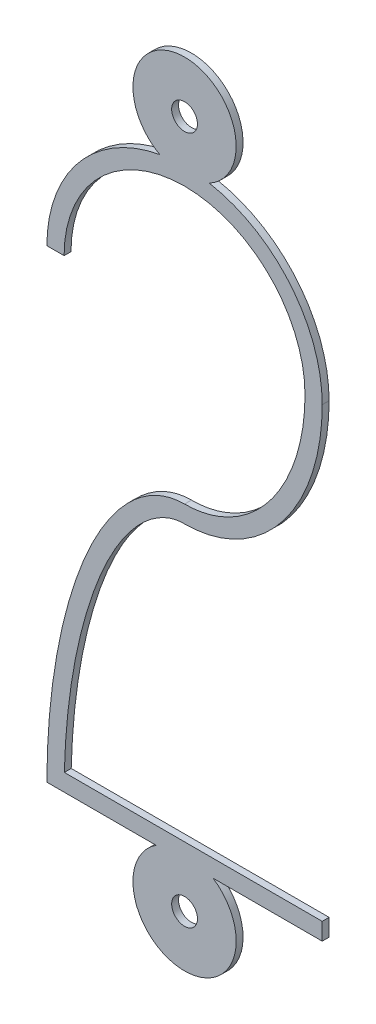
ISO-10303-21;
HEADER;
FILE_DESCRIPTION(('STEP AP214'),'2;1');
FILE_NAME('part.step','',(''),(''),'','','');
FILE_SCHEMA(('AUTOMOTIVE_DESIGN { 1 0 10303 214 1 1 1 1 }'));
ENDSEC;
DATA;
#1=APPLICATION_CONTEXT('core data for automotive mechanical design processes');
#2=APPLICATION_PROTOCOL_DEFINITION('international standard','automotive_design',2000,#1);
#3=PRODUCT_CONTEXT('',#1,'mechanical');
#4=PRODUCT('Part','Part','',(#3));
#5=PRODUCT_RELATED_PRODUCT_CATEGORY('part','',(#4));
#6=PRODUCT_DEFINITION_FORMATION('','',#4);
#7=PRODUCT_DEFINITION_CONTEXT('part definition',#1,'design');
#8=PRODUCT_DEFINITION('design','',#6,#7);
#9=PRODUCT_DEFINITION_SHAPE('','',#8);
#10=(LENGTH_UNIT() NAMED_UNIT(*) SI_UNIT(.MILLI.,.METRE.));
#11=(NAMED_UNIT(*) PLANE_ANGLE_UNIT() SI_UNIT($,.RADIAN.));
#12=(NAMED_UNIT(*) SI_UNIT($,.STERADIAN.) SOLID_ANGLE_UNIT());
#13=UNCERTAINTY_MEASURE_WITH_UNIT(LENGTH_MEASURE(1.E-05),#10,'distance_accuracy_value','');
#14=(GEOMETRIC_REPRESENTATION_CONTEXT(3) GLOBAL_UNCERTAINTY_ASSIGNED_CONTEXT((#13)) GLOBAL_UNIT_ASSIGNED_CONTEXT((#10,
#11,#12)) REPRESENTATION_CONTEXT('',''));
#15=CARTESIAN_POINT('',(0.,0.,0.));
#16=DIRECTION('',(0.,0.,1.));
#17=DIRECTION('',(1.,0.,0.));
#18=AXIS2_PLACEMENT_3D('',#15,#16,#17);
#19=CARTESIAN_POINT('',(0.,-8.75,0.1));
#20=DIRECTION('',(0.,0.,1.));
#21=DIRECTION('',(1.,0.,0.));
#22=AXIS2_PLACEMENT_3D('',#19,#20,#21);
#23=PLANE('',#22);
#24=CARTESIAN_POINT('',(0.,10.,0.1));
#25=DIRECTION('',(0.,0.,1.));
#26=DIRECTION('',(1.,0.,0.));
#27=AXIS2_PLACEMENT_3D('',#24,#25,#26);
#28=CIRCLE('',#27,0.375);
#29=CARTESIAN_POINT('',(0.375000000000002,10.,0.1));
#30=VERTEX_POINT('',#29);
#31=EDGE_CURVE('E290',#30,#30,#28,.T.);
#32=ORIENTED_EDGE('',*,*,#31,.F.);
#33=EDGE_LOOP('',(#32));
#34=FACE_BOUND('',#33,.T.);
#35=CARTESIAN_POINT('',(0.,-8.75,0.1));
#36=DIRECTION('',(0.,0.,1.));
#37=DIRECTION('',(0.,-1.,0.));
#38=AXIS2_PLACEMENT_3D('',#35,#36,#37);
#39=ELLIPSE('',#38,9.,4.);
#40=CARTESIAN_POINT('',(0.,0.25,0.1));
#41=VERTEX_POINT('',#40);
#42=CARTESIAN_POINT('',(-4.,-8.75,0.1));
#43=VERTEX_POINT('',#42);
#44=EDGE_CURVE('E286',#41,#43,#39,.T.);
#45=ORIENTED_EDGE('',*,*,#44,.T.);
#46=DIRECTION('',(1.,0.,0.));
#47=VECTOR('',#46,1.);
#48=CARTESIAN_POINT('',(-4.,-8.75,0.1));
#49=LINE('',#48,#47);
#50=CARTESIAN_POINT('',(-0.829156197588851,-8.75,0.1));
#51=VERTEX_POINT('',#50);
#52=EDGE_CURVE('E113',#43,#51,#49,.T.);
#53=ORIENTED_EDGE('',*,*,#52,.T.);
#54=CARTESIAN_POINT('',(0.,-10.,0.1));
#55=DIRECTION('',(0.,0.,1.));
#56=DIRECTION('',(1.,0.,0.));
#57=AXIS2_PLACEMENT_3D('',#54,#55,#56);
#58=CIRCLE('',#57,1.5);
#59=CARTESIAN_POINT('',(0.829156197588856,-8.75,0.1));
#60=VERTEX_POINT('',#59);
#61=EDGE_CURVE('E255',#51,#60,#58,.T.);
#62=ORIENTED_EDGE('',*,*,#61,.T.);
#63=DIRECTION('',(1.,0.,0.));
#64=VECTOR('',#63,1.);
#65=CARTESIAN_POINT('',(0.829156197588856,-8.75,0.1));
#66=LINE('',#65,#64);
#67=CARTESIAN_POINT('',(4.,-8.75,0.1));
#68=VERTEX_POINT('',#67);
#69=EDGE_CURVE('E306',#60,#68,#66,.T.);
#70=ORIENTED_EDGE('',*,*,#69,.T.);
#71=DIRECTION('',(0.,1.,0.));
#72=VECTOR('',#71,1.);
#73=CARTESIAN_POINT('',(4.,-8.75,0.1));
#74=LINE('',#73,#72);
#75=CARTESIAN_POINT('',(4.,-8.25,0.1));
#76=VERTEX_POINT('',#75);
#77=EDGE_CURVE('E308',#68,#76,#74,.T.);
#78=ORIENTED_EDGE('',*,*,#77,.T.);
#79=DIRECTION('',(-1.,0.,0.));
#80=VECTOR('',#79,1.);
#81=CARTESIAN_POINT('',(4.,-8.25,0.1));
#82=LINE('',#81,#80);
#83=CARTESIAN_POINT('',(-3.49366563897172,-8.25,0.1));
#84=VERTEX_POINT('',#83);
#85=EDGE_CURVE('E309',#76,#84,#82,.T.);
#86=ORIENTED_EDGE('',*,*,#85,.T.);
#87=CARTESIAN_POINT('',(-3.50006426004817,-8.74999971845769,0.1));
#88=CARTESIAN_POINT('',(-3.50006056152158,-8.17885806230436,0.1));
#89=CARTESIAN_POINT('',(-3.44964988153579,-7.02503319630397,0.1));
#90=CARTESIAN_POINT('',(-3.15272229711924,-4.82282843800991,0.1));
#91=CARTESIAN_POINT('',(-2.57822247255092,-2.89648588380917,0.1));
#92=CARTESIAN_POINT('',(-1.81455832713496,-1.49273960815074,0.1));
#93=CARTESIAN_POINT('',(-1.19033596288793,-0.745574392309451,0.1));
#94=CARTESIAN_POINT('',(-0.563172920007675,-0.33007672348668,0.1));
#95=CARTESIAN_POINT('',(-0.196814508086079,-0.249998725493591,0.1));
#96=CARTESIAN_POINT('',(0.,-0.249999999999989,0.1));
#97=B_SPLINE_CURVE_WITH_KNOTS('',3,(#87,#88,#89,#90,#91,#92,#93,#94,#95,#96),.UNSPECIFIED.,.F.,
.F.,(4,1,1,1,1,1,1,4),(3.14159265358979,3.33794219443916,3.53429173528852,3.92699081698724,
4.1233403578366,4.31968989868597,4.51603943953533,4.71238898038469),.UNSPECIFIED.);
#98=CARTESIAN_POINT('',(0.,-0.249999999999989,0.1));
#99=VERTEX_POINT('',#98);
#100=EDGE_CURVE('E207',#84,#99,#97,.T.);
#101=ORIENTED_EDGE('',*,*,#100,.T.);
#102=CARTESIAN_POINT('',(0.,4.75,0.1));
#103=DIRECTION('',(0.,0.,1.));
#104=DIRECTION('',(0.,1.,0.));
#105=AXIS2_PLACEMENT_3D('',#102,#103,#104);
#106=ELLIPSE('',#105,5.,4.);
#107=CARTESIAN_POINT('',(4.,4.75,0.1));
#108=VERTEX_POINT('',#107);
#109=EDGE_CURVE('E203',#99,#108,#106,.T.);
#110=ORIENTED_EDGE('',*,*,#109,.T.);
#111=CARTESIAN_POINT('',(0.,4.75,0.1));
#112=DIRECTION('',(0.,0.,1.));
#113=DIRECTION('',(-1.,0.,0.));
#114=AXIS2_PLACEMENT_3D('',#111,#112,#113);
#115=CIRCLE('',#114,4.);
#116=CARTESIAN_POINT('',(0.720779017653992,8.68452380952381,0.1));
#117=VERTEX_POINT('',#116);
#118=EDGE_CURVE('E206',#108,#117,#115,.T.);
#119=ORIENTED_EDGE('',*,*,#118,.T.);
#120=CARTESIAN_POINT('',(0.,10.,0.1));
#121=DIRECTION('',(0.,0.,1.));
#122=DIRECTION('',(1.,0.,0.));
#123=AXIS2_PLACEMENT_3D('',#120,#121,#122);
#124=CIRCLE('',#123,1.5);
#125=CARTESIAN_POINT('',(-0.720779017653989,8.68452380952381,0.1));
#126=VERTEX_POINT('',#125);
#127=EDGE_CURVE('E213',#117,#126,#124,.T.);
#128=ORIENTED_EDGE('',*,*,#127,.T.);
#129=CARTESIAN_POINT('',(0.,4.75,0.1));
#130=DIRECTION('',(0.,0.,1.));
#131=DIRECTION('',(-1.,0.,0.));
#132=AXIS2_PLACEMENT_3D('',#129,#130,#131);
#133=CIRCLE('',#132,4.);
#134=CARTESIAN_POINT('',(-4.,4.75,0.1));
#135=VERTEX_POINT('',#134);
#136=EDGE_CURVE('E150',#126,#135,#133,.T.);
#137=ORIENTED_EDGE('',*,*,#136,.T.);
#138=DIRECTION('',(1.,0.,0.));
#139=VECTOR('',#138,1.);
#140=CARTESIAN_POINT('',(-4.,4.75,0.1));
#141=LINE('',#140,#139);
#142=CARTESIAN_POINT('',(-3.5,4.75,0.1));
#143=VERTEX_POINT('',#142);
#144=EDGE_CURVE('E144',#135,#143,#141,.T.);
#145=ORIENTED_EDGE('',*,*,#144,.T.);
#146=CARTESIAN_POINT('',(0.,4.75,0.1));
#147=DIRECTION('',(0.,0.,-1.));
#148=DIRECTION('',(-1.,0.,0.));
#149=AXIS2_PLACEMENT_3D('',#146,#147,#148);
#150=CIRCLE('',#149,3.5);
#151=CARTESIAN_POINT('',(3.5,4.75,0.1));
#152=VERTEX_POINT('',#151);
#153=EDGE_CURVE('E148',#143,#152,#150,.T.);
#154=ORIENTED_EDGE('',*,*,#153,.T.);
#155=CARTESIAN_POINT('',(0.,4.75,0.1));
#156=DIRECTION('',(0.,0.,-1.));
#157=DIRECTION('',(0.,1.,0.));
#158=AXIS2_PLACEMENT_3D('',#155,#156,#157);
#159=ELLIPSE('',#158,4.5,3.5);
#160=EDGE_CURVE('E52',#152,#41,#159,.T.);
#161=ORIENTED_EDGE('',*,*,#160,.T.);
#162=EDGE_LOOP('',(#45,#53,#62,#70,#78,#86,#101,#110,#119,#128,#137,#145,#154,#161));
#163=FACE_BOUND('',#162,.T.);
#164=CARTESIAN_POINT('',(0.,-10.,0.1));
#165=DIRECTION('',(0.,0.,1.));
#166=DIRECTION('',(1.,0.,0.));
#167=AXIS2_PLACEMENT_3D('',#164,#165,#166);
#168=CIRCLE('',#167,0.375);
#169=CARTESIAN_POINT('',(0.375000000000002,-10.,0.1));
#170=VERTEX_POINT('',#169);
#171=EDGE_CURVE('E297',#170,#170,#168,.T.);
#172=ORIENTED_EDGE('',*,*,#171,.F.);
#173=EDGE_LOOP('',(#172));
#174=FACE_BOUND('',#173,.T.);
#175=ADVANCED_FACE('F34',(#34,#163,#174),#23,.T.);
#176=CARTESIAN_POINT('',(0.,-8.75,-0.1));
#177=DIRECTION('',(0.,0.,1.));
#178=DIRECTION('',(1.,0.,0.));
#179=AXIS2_PLACEMENT_3D('',#176,#177,#178);
#180=PLANE('',#179);
#181=CARTESIAN_POINT('',(0.,-8.75,-0.1));
#182=DIRECTION('',(0.,0.,1.));
#183=DIRECTION('',(0.,-1.,0.));
#184=AXIS2_PLACEMENT_3D('',#181,#182,#183);
#185=ELLIPSE('',#184,9.,4.);
#186=CARTESIAN_POINT('',(0.,0.25,-0.1));
#187=VERTEX_POINT('',#186);
#188=CARTESIAN_POINT('',(-4.,-8.75,-0.1));
#189=VERTEX_POINT('',#188);
#190=EDGE_CURVE('E169',#187,#189,#185,.T.);
#191=ORIENTED_EDGE('',*,*,#190,.F.);
#192=CARTESIAN_POINT('',(0.,4.75,-0.1));
#193=DIRECTION('',(0.,0.,-1.));
#194=DIRECTION('',(0.,1.,0.));
#195=AXIS2_PLACEMENT_3D('',#192,#193,#194);
#196=ELLIPSE('',#195,4.5,3.5);
#197=CARTESIAN_POINT('',(3.5,4.75,-0.1));
#198=VERTEX_POINT('',#197);
#199=EDGE_CURVE('E105',#198,#187,#196,.T.);
#200=ORIENTED_EDGE('',*,*,#199,.F.);
#201=CARTESIAN_POINT('',(0.,4.75,-0.1));
#202=DIRECTION('',(0.,0.,-1.));
#203=DIRECTION('',(-1.,0.,0.));
#204=AXIS2_PLACEMENT_3D('',#201,#202,#203);
#205=CIRCLE('',#204,3.5);
#206=CARTESIAN_POINT('',(-3.5,4.75,-0.1));
#207=VERTEX_POINT('',#206);
#208=EDGE_CURVE('E99',#207,#198,#205,.T.);
#209=ORIENTED_EDGE('',*,*,#208,.F.);
#210=DIRECTION('',(1.,0.,0.));
#211=VECTOR('',#210,1.);
#212=CARTESIAN_POINT('',(-4.,4.75,-0.1));
#213=LINE('',#212,#211);
#214=CARTESIAN_POINT('',(-4.,4.75,-0.1));
#215=VERTEX_POINT('',#214);
#216=EDGE_CURVE('E158',#215,#207,#213,.T.);
#217=ORIENTED_EDGE('',*,*,#216,.F.);
#218=CARTESIAN_POINT('',(0.,4.75,-0.1));
#219=DIRECTION('',(0.,0.,1.));
#220=DIRECTION('',(-1.,0.,0.));
#221=AXIS2_PLACEMENT_3D('',#218,#219,#220);
#222=CIRCLE('',#221,4.);
#223=CARTESIAN_POINT('',(-0.720779017653989,8.68452380952381,-0.1));
#224=VERTEX_POINT('',#223);
#225=EDGE_CURVE('E226',#224,#215,#222,.T.);
#226=ORIENTED_EDGE('',*,*,#225,.F.);
#227=CARTESIAN_POINT('',(0.,10.,-0.1));
#228=DIRECTION('',(0.,0.,1.));
#229=DIRECTION('',(1.,0.,0.));
#230=AXIS2_PLACEMENT_3D('',#227,#228,#229);
#231=CIRCLE('',#230,1.5);
#232=CARTESIAN_POINT('',(0.720779017653992,8.68452380952381,-0.1));
#233=VERTEX_POINT('',#232);
#234=EDGE_CURVE('E222',#233,#224,#231,.T.);
#235=ORIENTED_EDGE('',*,*,#234,.F.);
#236=CARTESIAN_POINT('',(0.,4.75,-0.1));
#237=DIRECTION('',(0.,0.,1.));
#238=DIRECTION('',(-1.,0.,0.));
#239=AXIS2_PLACEMENT_3D('',#236,#237,#238);
#240=CIRCLE('',#239,4.);
#241=CARTESIAN_POINT('',(4.,4.75,-0.1));
#242=VERTEX_POINT('',#241);
#243=EDGE_CURVE('E279',#242,#233,#240,.T.);
#244=ORIENTED_EDGE('',*,*,#243,.F.);
#245=CARTESIAN_POINT('',(0.,4.75,-0.1));
#246=DIRECTION('',(0.,0.,1.));
#247=DIRECTION('',(0.,1.,0.));
#248=AXIS2_PLACEMENT_3D('',#245,#246,#247);
#249=ELLIPSE('',#248,5.,4.);
#250=CARTESIAN_POINT('',(0.,-0.249999999999989,-0.1));
#251=VERTEX_POINT('',#250);
#252=EDGE_CURVE('E274',#251,#242,#249,.T.);
#253=ORIENTED_EDGE('',*,*,#252,.F.);
#254=CARTESIAN_POINT('',(-3.50006426004817,-8.74999971845769,-0.1));
#255=CARTESIAN_POINT('',(-3.50006056152158,-8.17885806230436,-0.1));
#256=CARTESIAN_POINT('',(-3.44964988153579,-7.02503319630397,-0.1));
#257=CARTESIAN_POINT('',(-3.15272229711924,-4.82282843800991,-0.1));
#258=CARTESIAN_POINT('',(-2.57822247255092,-2.89648588380917,-0.1));
#259=CARTESIAN_POINT('',(-1.81455832713496,-1.49273960815074,-0.1));
#260=CARTESIAN_POINT('',(-1.19033596288793,-0.745574392309451,-0.1));
#261=CARTESIAN_POINT('',(-0.563172920007675,-0.33007672348668,-0.1));
#262=CARTESIAN_POINT('',(-0.196814508086079,-0.249998725493591,-0.1));
#263=CARTESIAN_POINT('',(0.,-0.249999999999989,-0.1));
#264=B_SPLINE_CURVE_WITH_KNOTS('',3,(#254,#255,#256,#257,#258,#259,#260,#261,#262,#263),
.UNSPECIFIED.,.F.,.F.,(4,1,1,1,1,1,1,4),(3.14159265358979,3.33794219443916,3.53429173528852,
3.92699081698724,4.1233403578366,4.31968989868597,4.51603943953533,4.71238898038469),.UNSPECIFIED.);
#265=CARTESIAN_POINT('',(-3.49366563897172,-8.25,-0.1));
#266=VERTEX_POINT('',#265);
#267=EDGE_CURVE('E270',#266,#251,#264,.T.);
#268=ORIENTED_EDGE('',*,*,#267,.F.);
#269=DIRECTION('',(-1.,0.,0.));
#270=VECTOR('',#269,1.);
#271=CARTESIAN_POINT('',(4.,-8.25,-0.1));
#272=LINE('',#271,#270);
#273=CARTESIAN_POINT('',(4.,-8.25,-0.1));
#274=VERTEX_POINT('',#273);
#275=EDGE_CURVE('E268',#274,#266,#272,.T.);
#276=ORIENTED_EDGE('',*,*,#275,.F.);
#277=DIRECTION('',(0.,1.,0.));
#278=VECTOR('',#277,1.);
#279=CARTESIAN_POINT('',(4.,-8.75,-0.1));
#280=LINE('',#279,#278);
#281=CARTESIAN_POINT('',(4.,-8.75,-0.1));
#282=VERTEX_POINT('',#281);
#283=EDGE_CURVE('E264',#282,#274,#280,.T.);
#284=ORIENTED_EDGE('',*,*,#283,.F.);
#285=DIRECTION('',(1.,0.,0.));
#286=VECTOR('',#285,1.);
#287=CARTESIAN_POINT('',(0.829156197588856,-8.75,-0.1));
#288=LINE('',#287,#286);
#289=CARTESIAN_POINT('',(0.829156197588856,-8.75,-0.1));
#290=VERTEX_POINT('',#289);
#291=EDGE_CURVE('E262',#290,#282,#288,.T.);
#292=ORIENTED_EDGE('',*,*,#291,.F.);
#293=CARTESIAN_POINT('',(0.,-10.,-0.1));
#294=DIRECTION('',(0.,0.,1.));
#295=DIRECTION('',(1.,0.,0.));
#296=AXIS2_PLACEMENT_3D('',#293,#294,#295);
#297=CIRCLE('',#296,1.5);
#298=CARTESIAN_POINT('',(-0.829156197588851,-8.75,-0.1));
#299=VERTEX_POINT('',#298);
#300=EDGE_CURVE('E254',#299,#290,#297,.T.);
#301=ORIENTED_EDGE('',*,*,#300,.F.);
#302=DIRECTION('',(1.,0.,0.));
#303=VECTOR('',#302,1.);
#304=CARTESIAN_POINT('',(-4.,-8.75,-0.1));
#305=LINE('',#304,#303);
#306=EDGE_CURVE('E260',#189,#299,#305,.T.);
#307=ORIENTED_EDGE('',*,*,#306,.F.);
#308=EDGE_LOOP('',(#191,#200,#209,#217,#226,#235,#244,#253,#268,#276,#284,#292,#301,#307));
#309=FACE_BOUND('',#308,.T.);
#310=CARTESIAN_POINT('',(0.,10.,-0.1));
#311=DIRECTION('',(0.,0.,1.));
#312=DIRECTION('',(1.,0.,0.));
#313=AXIS2_PLACEMENT_3D('',#310,#311,#312);
#314=CIRCLE('',#313,0.375);
#315=CARTESIAN_POINT('',(0.375000000000002,10.,-0.1));
#316=VERTEX_POINT('',#315);
#317=EDGE_CURVE('E292',#316,#316,#314,.T.);
#318=ORIENTED_EDGE('',*,*,#317,.T.);
#319=EDGE_LOOP('',(#318));
#320=FACE_BOUND('',#319,.T.);
#321=CARTESIAN_POINT('',(0.,-10.,-0.1));
#322=DIRECTION('',(0.,0.,1.));
#323=DIRECTION('',(1.,0.,0.));
#324=AXIS2_PLACEMENT_3D('',#321,#322,#323);
#325=CIRCLE('',#324,0.375);
#326=CARTESIAN_POINT('',(0.375000000000002,-10.,-0.1));
#327=VERTEX_POINT('',#326);
#328=EDGE_CURVE('E300',#327,#327,#325,.T.);
#329=ORIENTED_EDGE('',*,*,#328,.T.);
#330=EDGE_LOOP('',(#329));
#331=FACE_BOUND('',#330,.T.);
#332=ADVANCED_FACE('F177',(#309,#320,#331),#180,.F.);
#333=DIRECTION('',(0.,0.,-1.));
#334=VECTOR('',#333,1.);
#335=SURFACE_OF_LINEAR_EXTRUSION('',#39,#334);
#336=ORIENTED_EDGE('',*,*,#190,.T.);
#337=DIRECTION('',(0.,0.,-1.));
#338=VECTOR('',#337,1.);
#339=CARTESIAN_POINT('',(-4.,-8.75,0.1));
#340=LINE('',#339,#338);
#341=EDGE_CURVE('E11',#43,#189,#340,.T.);
#342=ORIENTED_EDGE('',*,*,#341,.F.);
#343=ORIENTED_EDGE('',*,*,#44,.F.);
#344=DIRECTION('',(0.,0.,-1.));
#345=VECTOR('',#344,1.);
#346=CARTESIAN_POINT('',(0.,0.25,0.1));
#347=LINE('',#346,#345);
#348=EDGE_CURVE('E164',#41,#187,#347,.T.);
#349=ORIENTED_EDGE('',*,*,#348,.T.);
#350=EDGE_LOOP('',(#336,#342,#343,#349));
#351=FACE_BOUND('',#350,.T.);
#352=ADVANCED_FACE('F36',(#351),#335,.F.);
#353=CARTESIAN_POINT('',(-4.,-8.75,0.1));
#354=DIRECTION('',(0.,1.,0.));
#355=DIRECTION('',(0.,0.,1.));
#356=AXIS2_PLACEMENT_3D('',#353,#354,#355);
#357=PLANE('',#356);
#358=ORIENTED_EDGE('',*,*,#306,.T.);
#359=DIRECTION('',(0.,0.,-1.));
#360=VECTOR('',#359,1.);
#361=CARTESIAN_POINT('',(-0.829156197588851,-8.75,0.1));
#362=LINE('',#361,#360);
#363=EDGE_CURVE('E44',#51,#299,#362,.T.);
#364=ORIENTED_EDGE('',*,*,#363,.F.);
#365=ORIENTED_EDGE('',*,*,#52,.F.);
#366=ORIENTED_EDGE('',*,*,#341,.T.);
#367=EDGE_LOOP('',(#358,#364,#365,#366));
#368=FACE_BOUND('',#367,.T.);
#369=ADVANCED_FACE('F332',(#368),#357,.F.);
#370=CARTESIAN_POINT('',(0.,-10.,0.1));
#371=DIRECTION('',(0.,0.,-1.));
#372=DIRECTION('',(-1.,0.,0.));
#373=AXIS2_PLACEMENT_3D('',#370,#371,#372);
#374=CYLINDRICAL_SURFACE('',#373,1.5);
#375=ORIENTED_EDGE('',*,*,#300,.T.);
#376=DIRECTION('',(0.,0.,-1.));
#377=VECTOR('',#376,1.);
#378=CARTESIAN_POINT('',(0.829156197588856,-8.75,0.1));
#379=LINE('',#378,#377);
#380=EDGE_CURVE('E246',#60,#290,#379,.T.);
#381=ORIENTED_EDGE('',*,*,#380,.F.);
#382=ORIENTED_EDGE('',*,*,#61,.F.);
#383=ORIENTED_EDGE('',*,*,#363,.T.);
#384=EDGE_LOOP('',(#375,#381,#382,#383));
#385=FACE_BOUND('',#384,.T.);
#386=ADVANCED_FACE('F252',(#385),#374,.T.);
#387=CARTESIAN_POINT('',(0.829156197588856,-8.75,0.1));
#388=DIRECTION('',(0.,1.,0.));
#389=DIRECTION('',(-1.,0.,0.));
#390=AXIS2_PLACEMENT_3D('',#387,#388,#389);
#391=PLANE('',#390);
#392=ORIENTED_EDGE('',*,*,#291,.T.);
#393=DIRECTION('',(0.,0.,-1.));
#394=VECTOR('',#393,1.);
#395=CARTESIAN_POINT('',(4.,-8.75,0.1));
#396=LINE('',#395,#394);
#397=EDGE_CURVE('E243',#68,#282,#396,.T.);
#398=ORIENTED_EDGE('',*,*,#397,.F.);
#399=ORIENTED_EDGE('',*,*,#69,.F.);
#400=ORIENTED_EDGE('',*,*,#380,.T.);
#401=EDGE_LOOP('',(#392,#398,#399,#400));
#402=FACE_BOUND('',#401,.T.);
#403=ADVANCED_FACE('F330',(#402),#391,.F.);
#404=CARTESIAN_POINT('',(4.,-8.75,0.1));
#405=DIRECTION('',(-1.,0.,0.));
#406=DIRECTION('',(0.,0.,1.));
#407=AXIS2_PLACEMENT_3D('',#404,#405,#406);
#408=PLANE('',#407);
#409=ORIENTED_EDGE('',*,*,#283,.T.);
#410=DIRECTION('',(0.,0.,-1.));
#411=VECTOR('',#410,1.);
#412=CARTESIAN_POINT('',(4.,-8.25,0.1));
#413=LINE('',#412,#411);
#414=EDGE_CURVE('E240',#76,#274,#413,.T.);
#415=ORIENTED_EDGE('',*,*,#414,.F.);
#416=ORIENTED_EDGE('',*,*,#77,.F.);
#417=ORIENTED_EDGE('',*,*,#397,.T.);
#418=EDGE_LOOP('',(#409,#415,#416,#417));
#419=FACE_BOUND('',#418,.T.);
#420=ADVANCED_FACE('F326',(#419),#408,.F.);
#421=CARTESIAN_POINT('',(4.,-8.25,0.1));
#422=DIRECTION('',(0.,-1.,0.));
#423=DIRECTION('',(0.,0.,-1.));
#424=AXIS2_PLACEMENT_3D('',#421,#422,#423);
#425=PLANE('',#424);
#426=ORIENTED_EDGE('',*,*,#275,.T.);
#427=DIRECTION('',(0.,0.,-1.));
#428=VECTOR('',#427,1.);
#429=CARTESIAN_POINT('',(-3.49366563897172,-8.25,0.1));
#430=LINE('',#429,#428);
#431=EDGE_CURVE('E237',#84,#266,#430,.T.);
#432=ORIENTED_EDGE('',*,*,#431,.F.);
#433=ORIENTED_EDGE('',*,*,#85,.F.);
#434=ORIENTED_EDGE('',*,*,#414,.T.);
#435=EDGE_LOOP('',(#426,#432,#433,#434));
#436=FACE_BOUND('',#435,.T.);
#437=ADVANCED_FACE('F322',(#436),#425,.F.);
#438=DIRECTION('',(0.,0.,-1.));
#439=VECTOR('',#438,1.);
#440=SURFACE_OF_LINEAR_EXTRUSION('',#97,#439);
#441=ORIENTED_EDGE('',*,*,#267,.T.);
#442=DIRECTION('',(0.,0.,-1.));
#443=VECTOR('',#442,1.);
#444=CARTESIAN_POINT('',(0.,-0.249999999999989,0.1));
#445=LINE('',#444,#443);
#446=EDGE_CURVE('E234',#99,#251,#445,.T.);
#447=ORIENTED_EDGE('',*,*,#446,.F.);
#448=ORIENTED_EDGE('',*,*,#100,.F.);
#449=ORIENTED_EDGE('',*,*,#431,.T.);
#450=EDGE_LOOP('',(#441,#447,#448,#449));
#451=FACE_BOUND('',#450,.T.);
#452=ADVANCED_FACE('F199',(#451),#440,.F.);
#453=DIRECTION('',(0.,0.,-1.));
#454=VECTOR('',#453,1.);
#455=SURFACE_OF_LINEAR_EXTRUSION('',#106,#454);
#456=ORIENTED_EDGE('',*,*,#252,.T.);
#457=DIRECTION('',(0.,0.,-1.));
#458=VECTOR('',#457,1.);
#459=CARTESIAN_POINT('',(4.,4.75,0.1));
#460=LINE('',#459,#458);
#461=EDGE_CURVE('E231',#108,#242,#460,.T.);
#462=ORIENTED_EDGE('',*,*,#461,.F.);
#463=ORIENTED_EDGE('',*,*,#109,.F.);
#464=ORIENTED_EDGE('',*,*,#446,.T.);
#465=EDGE_LOOP('',(#456,#462,#463,#464));
#466=FACE_BOUND('',#465,.T.);
#467=ADVANCED_FACE('F194',(#466),#455,.F.);
#468=CARTESIAN_POINT('',(0.,4.75,0.1));
#469=DIRECTION('',(0.,0.,-1.));
#470=DIRECTION('',(-1.,0.,0.));
#471=AXIS2_PLACEMENT_3D('',#468,#469,#470);
#472=CYLINDRICAL_SURFACE('',#471,4.);
#473=ORIENTED_EDGE('',*,*,#243,.T.);
#474=DIRECTION('',(0.,0.,-1.));
#475=VECTOR('',#474,1.);
#476=CARTESIAN_POINT('',(0.720779017653992,8.68452380952381,0.1));
#477=LINE('',#476,#475);
#478=EDGE_CURVE('E224',#117,#233,#477,.T.);
#479=ORIENTED_EDGE('',*,*,#478,.F.);
#480=ORIENTED_EDGE('',*,*,#118,.F.);
#481=ORIENTED_EDGE('',*,*,#461,.T.);
#482=EDGE_LOOP('',(#473,#479,#480,#481));
#483=FACE_BOUND('',#482,.T.);
#484=ADVANCED_FACE('F190',(#483),#472,.T.);
#485=CARTESIAN_POINT('',(0.,10.,0.1));
#486=DIRECTION('',(0.,0.,-1.));
#487=DIRECTION('',(-1.,0.,0.));
#488=AXIS2_PLACEMENT_3D('',#485,#486,#487);
#489=CYLINDRICAL_SURFACE('',#488,1.5);
#490=ORIENTED_EDGE('',*,*,#234,.T.);
#491=DIRECTION('',(0.,0.,-1.));
#492=VECTOR('',#491,1.);
#493=CARTESIAN_POINT('',(-0.720779017653989,8.68452380952381,0.1));
#494=LINE('',#493,#492);
#495=EDGE_CURVE('E220',#126,#224,#494,.T.);
#496=ORIENTED_EDGE('',*,*,#495,.F.);
#497=ORIENTED_EDGE('',*,*,#127,.F.);
#498=ORIENTED_EDGE('',*,*,#478,.T.);
#499=EDGE_LOOP('',(#490,#496,#497,#498));
#500=FACE_BOUND('',#499,.T.);
#501=ADVANCED_FACE('F186',(#500),#489,.T.);
#502=CARTESIAN_POINT('',(0.,4.75,0.1));
#503=DIRECTION('',(0.,0.,-1.));
#504=DIRECTION('',(-1.,0.,0.));
#505=AXIS2_PLACEMENT_3D('',#502,#503,#504);
#506=CYLINDRICAL_SURFACE('',#505,4.);
#507=ORIENTED_EDGE('',*,*,#225,.T.);
#508=DIRECTION('',(0.,0.,-1.));
#509=VECTOR('',#508,1.);
#510=CARTESIAN_POINT('',(-4.,4.75,0.1));
#511=LINE('',#510,#509);
#512=EDGE_CURVE('E159',#135,#215,#511,.T.);
#513=ORIENTED_EDGE('',*,*,#512,.F.);
#514=ORIENTED_EDGE('',*,*,#136,.F.);
#515=ORIENTED_EDGE('',*,*,#495,.T.);
#516=EDGE_LOOP('',(#507,#513,#514,#515));
#517=FACE_BOUND('',#516,.T.);
#518=ADVANCED_FACE('F183',(#517),#506,.T.);
#519=CARTESIAN_POINT('',(-4.,4.75,0.1));
#520=DIRECTION('',(0.,1.,0.));
#521=DIRECTION('',(-1.,0.,0.));
#522=AXIS2_PLACEMENT_3D('',#519,#520,#521);
#523=PLANE('',#522);
#524=ORIENTED_EDGE('',*,*,#216,.T.);
#525=DIRECTION('',(0.,0.,-1.));
#526=VECTOR('',#525,1.);
#527=CARTESIAN_POINT('',(-3.5,4.75,0.1));
#528=LINE('',#527,#526);
#529=EDGE_CURVE('E155',#143,#207,#528,.T.);
#530=ORIENTED_EDGE('',*,*,#529,.F.);
#531=ORIENTED_EDGE('',*,*,#144,.F.);
#532=ORIENTED_EDGE('',*,*,#512,.T.);
#533=EDGE_LOOP('',(#524,#530,#531,#532));
#534=FACE_BOUND('',#533,.T.);
#535=ADVANCED_FACE('F156',(#534),#523,.F.);
#536=CARTESIAN_POINT('',(0.,4.75,0.1));
#537=DIRECTION('',(0.,0.,-1.));
#538=DIRECTION('',(-1.,0.,0.));
#539=AXIS2_PLACEMENT_3D('',#536,#537,#538);
#540=CYLINDRICAL_SURFACE('',#539,3.5);
#541=ORIENTED_EDGE('',*,*,#208,.T.);
#542=DIRECTION('',(0.,0.,-1.));
#543=VECTOR('',#542,1.);
#544=CARTESIAN_POINT('',(3.5,4.75,0.1));
#545=LINE('',#544,#543);
#546=EDGE_CURVE('E160',#152,#198,#545,.T.);
#547=ORIENTED_EDGE('',*,*,#546,.F.);
#548=ORIENTED_EDGE('',*,*,#153,.F.);
#549=ORIENTED_EDGE('',*,*,#529,.T.);
#550=EDGE_LOOP('',(#541,#547,#548,#549));
#551=FACE_BOUND('',#550,.T.);
#552=ADVANCED_FACE('F162',(#551),#540,.F.);
#553=DIRECTION('',(0.,0.,-1.));
#554=VECTOR('',#553,1.);
#555=SURFACE_OF_LINEAR_EXTRUSION('',#159,#554);
#556=ORIENTED_EDGE('',*,*,#199,.T.);
#557=ORIENTED_EDGE('',*,*,#348,.F.);
#558=ORIENTED_EDGE('',*,*,#160,.F.);
#559=ORIENTED_EDGE('',*,*,#546,.T.);
#560=EDGE_LOOP('',(#556,#557,#558,#559));
#561=FACE_BOUND('',#560,.T.);
#562=ADVANCED_FACE('F172',(#561),#555,.F.);
#563=CARTESIAN_POINT('',(0.,10.,0.1));
#564=DIRECTION('',(0.,0.,-1.));
#565=DIRECTION('',(-1.,0.,0.));
#566=AXIS2_PLACEMENT_3D('',#563,#564,#565);
#567=CYLINDRICAL_SURFACE('',#566,0.375);
#568=ORIENTED_EDGE('',*,*,#31,.T.);
#569=EDGE_LOOP('',(#568));
#570=FACE_BOUND('',#569,.T.);
#571=ORIENTED_EDGE('',*,*,#317,.F.);
#572=EDGE_LOOP('',(#571));
#573=FACE_BOUND('',#572,.T.);
#574=ADVANCED_FACE('F176',(#570,#573),#567,.F.);
#575=CARTESIAN_POINT('',(0.,-10.,0.1));
#576=DIRECTION('',(0.,0.,-1.));
#577=DIRECTION('',(-1.,0.,0.));
#578=AXIS2_PLACEMENT_3D('',#575,#576,#577);
#579=CYLINDRICAL_SURFACE('',#578,0.375);
#580=ORIENTED_EDGE('',*,*,#171,.T.);
#581=EDGE_LOOP('',(#580));
#582=FACE_BOUND('',#581,.T.);
#583=ORIENTED_EDGE('',*,*,#328,.F.);
#584=EDGE_LOOP('',(#583));
#585=FACE_BOUND('',#584,.T.);
#586=ADVANCED_FACE('F347',(#582,#585),#579,.F.);
#587=CLOSED_SHELL('',(#175,#332,#352,#369,#386,#403,#420,#437,#452,#467,#484,#501,#518,#535,
#552,#562,#574,#586));
#588=MANIFOLD_SOLID_BREP('B2',#587);
#589=ADVANCED_BREP_SHAPE_REPRESENTATION('',(#18,#588),#14);
#590=SHAPE_DEFINITION_REPRESENTATION(#9,#589);
ENDSEC;
END-ISO-10303-21;
